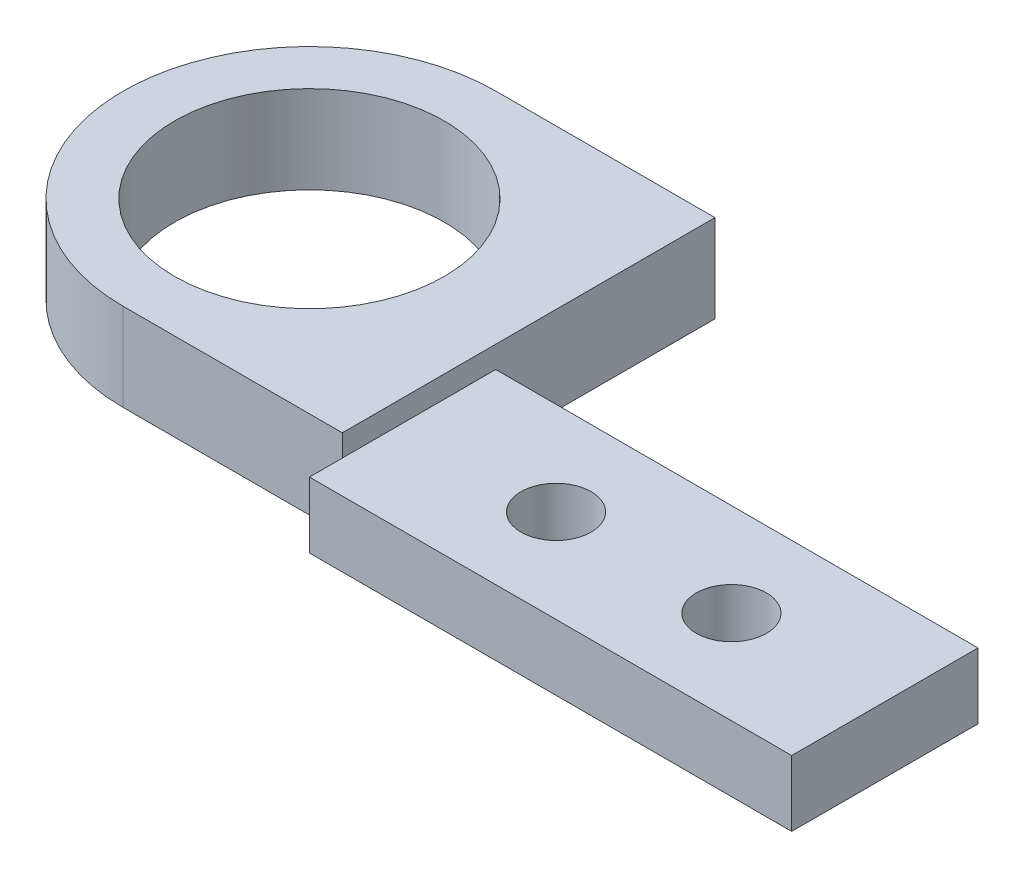
ISO-10303-21;
HEADER;
FILE_DESCRIPTION(('STEP AP214'),'2;1');
FILE_NAME('part.step','',(''),(''),'','','');
FILE_SCHEMA(('AUTOMOTIVE_DESIGN { 1 0 10303 214 1 1 1 1 }'));
ENDSEC;
DATA;
#1=APPLICATION_CONTEXT('core data for automotive mechanical design processes');
#2=APPLICATION_PROTOCOL_DEFINITION('international standard','automotive_design',2000,#1);
#3=PRODUCT_CONTEXT('',#1,'mechanical');
#4=PRODUCT('Part','Part','',(#3));
#5=PRODUCT_RELATED_PRODUCT_CATEGORY('part','',(#4));
#6=PRODUCT_DEFINITION_FORMATION('','',#4);
#7=PRODUCT_DEFINITION_CONTEXT('part definition',#1,'design');
#8=PRODUCT_DEFINITION('design','',#6,#7);
#9=PRODUCT_DEFINITION_SHAPE('','',#8);
#10=(LENGTH_UNIT() NAMED_UNIT(*) SI_UNIT(.MILLI.,.METRE.));
#11=(NAMED_UNIT(*) PLANE_ANGLE_UNIT() SI_UNIT($,.RADIAN.));
#12=(NAMED_UNIT(*) SI_UNIT($,.STERADIAN.) SOLID_ANGLE_UNIT());
#13=UNCERTAINTY_MEASURE_WITH_UNIT(LENGTH_MEASURE(1.E-05),#10,'distance_accuracy_value','');
#14=(GEOMETRIC_REPRESENTATION_CONTEXT(3) GLOBAL_UNCERTAINTY_ASSIGNED_CONTEXT((#13)) GLOBAL_UNIT_ASSIGNED_CONTEXT((#10,
#11,#12)) REPRESENTATION_CONTEXT('',''));
#15=CARTESIAN_POINT('',(0.,0.,0.));
#16=DIRECTION('',(0.,0.,1.));
#17=DIRECTION('',(1.,0.,0.));
#18=AXIS2_PLACEMENT_3D('',#15,#16,#17);
#19=CARTESIAN_POINT('',(0.,4.,0.));
#20=DIRECTION('',(0.,-1.,0.));
#21=DIRECTION('',(0.,0.,-1.));
#22=AXIS2_PLACEMENT_3D('',#19,#20,#21);
#23=CYLINDRICAL_SURFACE('',#22,8.5);
#24=CARTESIAN_POINT('',(0.,0.,0.));
#25=DIRECTION('',(0.,1.,0.));
#26=DIRECTION('',(0.,0.,1.));
#27=AXIS2_PLACEMENT_3D('',#24,#25,#26);
#28=CIRCLE('',#27,8.5);
#29=CARTESIAN_POINT('',(0.,0.,-8.5));
#30=VERTEX_POINT('',#29);
#31=CARTESIAN_POINT('',(0.,0.,8.5));
#32=VERTEX_POINT('',#31);
#33=EDGE_CURVE('E174',#30,#32,#28,.T.);
#34=ORIENTED_EDGE('',*,*,#33,.T.);
#35=DIRECTION('',(0.,-1.,0.));
#36=VECTOR('',#35,1.);
#37=CARTESIAN_POINT('',(0.,4.,8.5));
#38=LINE('',#37,#36);
#39=CARTESIAN_POINT('',(0.,4.,8.5));
#40=VERTEX_POINT('',#39);
#41=EDGE_CURVE('E11',#40,#32,#38,.T.);
#42=ORIENTED_EDGE('',*,*,#41,.F.);
#43=CARTESIAN_POINT('',(0.,4.,0.));
#44=DIRECTION('',(0.,1.,0.));
#45=DIRECTION('',(0.,0.,1.));
#46=AXIS2_PLACEMENT_3D('',#43,#44,#45);
#47=CIRCLE('',#46,8.5);
#48=CARTESIAN_POINT('',(0.,4.,-8.5));
#49=VERTEX_POINT('',#48);
#50=EDGE_CURVE('E164',#49,#40,#47,.T.);
#51=ORIENTED_EDGE('',*,*,#50,.F.);
#52=DIRECTION('',(0.,-1.,0.));
#53=VECTOR('',#52,1.);
#54=CARTESIAN_POINT('',(0.,4.,-8.5));
#55=LINE('',#54,#53);
#56=EDGE_CURVE('E54',#49,#30,#55,.T.);
#57=ORIENTED_EDGE('',*,*,#56,.T.);
#58=EDGE_LOOP('',(#34,#42,#51,#57));
#59=FACE_BOUND('',#58,.T.);
#60=ADVANCED_FACE('F35',(#59),#23,.T.);
#61=CARTESIAN_POINT('',(0.,4.,8.5));
#62=DIRECTION('',(0.,0.,-1.));
#63=DIRECTION('',(-1.,0.,0.));
#64=AXIS2_PLACEMENT_3D('',#61,#62,#63);
#65=PLANE('',#64);
#66=DIRECTION('',(1.,0.,0.));
#67=VECTOR('',#66,1.);
#68=CARTESIAN_POINT('',(0.,0.,8.5));
#69=LINE('',#68,#67);
#70=CARTESIAN_POINT('',(10.,0.,8.5));
#71=VERTEX_POINT('',#70);
#72=EDGE_CURVE('E176',#32,#71,#69,.T.);
#73=ORIENTED_EDGE('',*,*,#72,.T.);
#74=DIRECTION('',(0.,-1.,0.));
#75=VECTOR('',#74,1.);
#76=CARTESIAN_POINT('',(10.,4.,8.5));
#77=LINE('',#76,#75);
#78=CARTESIAN_POINT('',(10.,3.,8.5));
#79=VERTEX_POINT('',#78);
#80=EDGE_CURVE('E137',#79,#71,#77,.T.);
#81=ORIENTED_EDGE('',*,*,#80,.F.);
#82=CARTESIAN_POINT('',(10.,4.,8.5));
#83=VERTEX_POINT('',#82);
#84=EDGE_CURVE('E45',#83,#79,#77,.T.);
#85=ORIENTED_EDGE('',*,*,#84,.F.);
#86=DIRECTION('',(1.,0.,0.));
#87=VECTOR('',#86,1.);
#88=CARTESIAN_POINT('',(0.,4.,8.5));
#89=LINE('',#88,#87);
#90=EDGE_CURVE('E91',#40,#83,#89,.T.);
#91=ORIENTED_EDGE('',*,*,#90,.F.);
#92=ORIENTED_EDGE('',*,*,#41,.T.);
#93=EDGE_LOOP('',(#73,#81,#85,#91,#92));
#94=FACE_BOUND('',#93,.T.);
#95=ADVANCED_FACE('F209',(#94),#65,.F.);
#96=CARTESIAN_POINT('',(9.99999999999999,4.,0.));
#97=DIRECTION('',(1.,0.,0.));
#98=DIRECTION('',(0.,0.,-1.));
#99=AXIS2_PLACEMENT_3D('',#96,#97,#98);
#100=PLANE('',#99);
#101=DIRECTION('',(0.,-1.,0.));
#102=VECTOR('',#101,1.);
#103=CARTESIAN_POINT('',(10.,4.,10.));
#104=LINE('',#103,#102);
#105=CARTESIAN_POINT('',(10.,3.,10.));
#106=VERTEX_POINT('',#105);
#107=CARTESIAN_POINT('',(10.,0.,10.));
#108=VERTEX_POINT('',#107);
#109=EDGE_CURVE('E128',#106,#108,#104,.T.);
#110=ORIENTED_EDGE('',*,*,#109,.F.);
#111=DIRECTION('',(0.,0.,1.));
#112=VECTOR('',#111,1.);
#113=CARTESIAN_POINT('',(10.,3.,10.));
#114=LINE('',#113,#112);
#115=EDGE_CURVE('E113',#79,#106,#114,.T.);
#116=ORIENTED_EDGE('',*,*,#115,.F.);
#117=ORIENTED_EDGE('',*,*,#80,.T.);
#118=DIRECTION('',(0.,0.,1.));
#119=VECTOR('',#118,1.);
#120=CARTESIAN_POINT('',(9.99999999999999,0.,0.));
#121=LINE('',#120,#119);
#122=EDGE_CURVE('E135',#71,#108,#121,.T.);
#123=ORIENTED_EDGE('',*,*,#122,.T.);
#124=EDGE_LOOP('',(#110,#116,#117,#123));
#125=FACE_BOUND('',#124,.T.);
#126=ADVANCED_FACE('F133',(#125),#100,.F.);
#127=CARTESIAN_POINT('',(0.,4.,10.));
#128=DIRECTION('',(0.,0.,-1.));
#129=DIRECTION('',(-1.,0.,0.));
#130=AXIS2_PLACEMENT_3D('',#127,#128,#129);
#131=PLANE('',#130);
#132=DIRECTION('',(0.,-1.,0.));
#133=VECTOR('',#132,1.);
#134=CARTESIAN_POINT('',(32.,4.,10.));
#135=LINE('',#134,#133);
#136=CARTESIAN_POINT('',(32.,3.,10.));
#137=VERTEX_POINT('',#136);
#138=CARTESIAN_POINT('',(32.,0.,10.));
#139=VERTEX_POINT('',#138);
#140=EDGE_CURVE('E130',#137,#139,#135,.T.);
#141=ORIENTED_EDGE('',*,*,#140,.F.);
#142=DIRECTION('',(1.,0.,0.));
#143=VECTOR('',#142,1.);
#144=CARTESIAN_POINT('',(10.,3.,10.));
#145=LINE('',#144,#143);
#146=EDGE_CURVE('E116',#106,#137,#145,.T.);
#147=ORIENTED_EDGE('',*,*,#146,.F.);
#148=ORIENTED_EDGE('',*,*,#109,.T.);
#149=DIRECTION('',(1.,0.,0.));
#150=VECTOR('',#149,1.);
#151=CARTESIAN_POINT('',(0.,0.,10.));
#152=LINE('',#151,#150);
#153=EDGE_CURVE('E180',#108,#139,#152,.T.);
#154=ORIENTED_EDGE('',*,*,#153,.T.);
#155=EDGE_LOOP('',(#141,#147,#148,#154));
#156=FACE_BOUND('',#155,.T.);
#157=ADVANCED_FACE('F126',(#156),#131,.F.);
#158=CARTESIAN_POINT('',(32.,4.,0.));
#159=DIRECTION('',(1.,0.,0.));
#160=DIRECTION('',(0.,0.,-1.));
#161=AXIS2_PLACEMENT_3D('',#158,#159,#160);
#162=PLANE('',#161);
#163=DIRECTION('',(0.,0.,-1.));
#164=VECTOR('',#163,1.);
#165=CARTESIAN_POINT('',(32.,3.,10.));
#166=LINE('',#165,#164);
#167=CARTESIAN_POINT('',(32.,3.,1.5));
#168=VERTEX_POINT('',#167);
#169=EDGE_CURVE('E131',#137,#168,#166,.T.);
#170=ORIENTED_EDGE('',*,*,#169,.F.);
#171=ORIENTED_EDGE('',*,*,#140,.T.);
#172=DIRECTION('',(0.,0.,1.));
#173=VECTOR('',#172,1.);
#174=CARTESIAN_POINT('',(32.,0.,0.));
#175=LINE('',#174,#173);
#176=CARTESIAN_POINT('',(32.,0.,1.5));
#177=VERTEX_POINT('',#176);
#178=EDGE_CURVE('E182',#177,#139,#175,.T.);
#179=ORIENTED_EDGE('',*,*,#178,.F.);
#180=DIRECTION('',(0.,-1.,0.));
#181=VECTOR('',#180,1.);
#182=CARTESIAN_POINT('',(32.,4.,1.5));
#183=LINE('',#182,#181);
#184=EDGE_CURVE('E140',#168,#177,#183,.T.);
#185=ORIENTED_EDGE('',*,*,#184,.F.);
#186=EDGE_LOOP('',(#170,#171,#179,#185));
#187=FACE_BOUND('',#186,.T.);
#188=ADVANCED_FACE('F203',(#187),#162,.T.);
#189=CARTESIAN_POINT('',(0.,4.,1.5));
#190=DIRECTION('',(0.,0.,-1.));
#191=DIRECTION('',(-1.,0.,0.));
#192=AXIS2_PLACEMENT_3D('',#189,#190,#191);
#193=PLANE('',#192);
#194=DIRECTION('',(-1.,0.,0.));
#195=VECTOR('',#194,1.);
#196=CARTESIAN_POINT('',(10.,3.,1.5));
#197=LINE('',#196,#195);
#198=CARTESIAN_POINT('',(10.,3.,1.5));
#199=VERTEX_POINT('',#198);
#200=EDGE_CURVE('E158',#168,#199,#197,.T.);
#201=ORIENTED_EDGE('',*,*,#200,.F.);
#202=ORIENTED_EDGE('',*,*,#184,.T.);
#203=DIRECTION('',(1.,0.,0.));
#204=VECTOR('',#203,1.);
#205=CARTESIAN_POINT('',(0.,0.,1.5));
#206=LINE('',#205,#204);
#207=CARTESIAN_POINT('',(10.,0.,1.5));
#208=VERTEX_POINT('',#207);
#209=EDGE_CURVE('E185',#208,#177,#206,.T.);
#210=ORIENTED_EDGE('',*,*,#209,.F.);
#211=DIRECTION('',(0.,-1.,0.));
#212=VECTOR('',#211,1.);
#213=CARTESIAN_POINT('',(10.,4.,1.5));
#214=LINE('',#213,#212);
#215=EDGE_CURVE('E194',#199,#208,#214,.T.);
#216=ORIENTED_EDGE('',*,*,#215,.F.);
#217=EDGE_LOOP('',(#201,#202,#210,#216));
#218=FACE_BOUND('',#217,.T.);
#219=ADVANCED_FACE('F200',(#218),#193,.T.);
#220=CARTESIAN_POINT('',(10.,4.,0.));
#221=DIRECTION('',(-1.,0.,0.));
#222=DIRECTION('',(0.,0.,1.));
#223=AXIS2_PLACEMENT_3D('',#220,#221,#222);
#224=PLANE('',#223);
#225=DIRECTION('',(0.,0.,-1.));
#226=VECTOR('',#225,1.);
#227=CARTESIAN_POINT('',(10.,0.,0.));
#228=LINE('',#227,#226);
#229=CARTESIAN_POINT('',(10.,0.,-8.5));
#230=VERTEX_POINT('',#229);
#231=EDGE_CURVE('E188',#208,#230,#228,.T.);
#232=ORIENTED_EDGE('',*,*,#231,.T.);
#233=DIRECTION('',(0.,-1.,0.));
#234=VECTOR('',#233,1.);
#235=CARTESIAN_POINT('',(10.,4.,-8.5));
#236=LINE('',#235,#234);
#237=CARTESIAN_POINT('',(10.,4.,-8.5));
#238=VERTEX_POINT('',#237);
#239=EDGE_CURVE('E82',#238,#230,#236,.T.);
#240=ORIENTED_EDGE('',*,*,#239,.F.);
#241=DIRECTION('',(0.,0.,-1.));
#242=VECTOR('',#241,1.);
#243=CARTESIAN_POINT('',(10.,4.,0.));
#244=LINE('',#243,#242);
#245=EDGE_CURVE('E168',#83,#238,#244,.T.);
#246=ORIENTED_EDGE('',*,*,#245,.F.);
#247=ORIENTED_EDGE('',*,*,#84,.T.);
#248=EDGE_CURVE('E119',#199,#79,#114,.T.);
#249=ORIENTED_EDGE('',*,*,#248,.F.);
#250=ORIENTED_EDGE('',*,*,#215,.T.);
#251=EDGE_LOOP('',(#232,#240,#246,#247,#249,#250));
#252=FACE_BOUND('',#251,.T.);
#253=ADVANCED_FACE('F208',(#252),#224,.F.);
#254=CARTESIAN_POINT('',(0.,4.,0.));
#255=DIRECTION('',(0.,-1.,0.));
#256=DIRECTION('',(0.,0.,-1.));
#257=AXIS2_PLACEMENT_3D('',#254,#255,#256);
#258=CYLINDRICAL_SURFACE('',#257,6.15);
#259=CARTESIAN_POINT('',(0.,4.,0.));
#260=DIRECTION('',(0.,1.,0.));
#261=DIRECTION('',(0.,0.,1.));
#262=AXIS2_PLACEMENT_3D('',#259,#260,#261);
#263=CIRCLE('',#262,6.15);
#264=CARTESIAN_POINT('',(0.,4.,6.15));
#265=VERTEX_POINT('',#264);
#266=EDGE_CURVE('E161',#265,#265,#263,.T.);
#267=ORIENTED_EDGE('',*,*,#266,.T.);
#268=EDGE_LOOP('',(#267));
#269=FACE_BOUND('',#268,.T.);
#270=CARTESIAN_POINT('',(0.,0.,0.));
#271=DIRECTION('',(0.,1.,0.));
#272=DIRECTION('',(0.,0.,1.));
#273=AXIS2_PLACEMENT_3D('',#270,#271,#272);
#274=CIRCLE('',#273,6.15);
#275=CARTESIAN_POINT('',(0.,0.,6.15));
#276=VERTEX_POINT('',#275);
#277=EDGE_CURVE('E160',#276,#276,#274,.T.);
#278=ORIENTED_EDGE('',*,*,#277,.F.);
#279=EDGE_LOOP('',(#278));
#280=FACE_BOUND('',#279,.T.);
#281=ADVANCED_FACE('F37',(#269,#280),#258,.F.);
#282=CARTESIAN_POINT('',(0.,4.,-8.5));
#283=DIRECTION('',(0.,0.,-1.));
#284=DIRECTION('',(-1.,0.,0.));
#285=AXIS2_PLACEMENT_3D('',#282,#283,#284);
#286=PLANE('',#285);
#287=DIRECTION('',(1.,0.,0.));
#288=VECTOR('',#287,1.);
#289=CARTESIAN_POINT('',(0.,0.,-8.5));
#290=LINE('',#289,#288);
#291=EDGE_CURVE('E165',#30,#230,#290,.T.);
#292=ORIENTED_EDGE('',*,*,#291,.F.);
#293=ORIENTED_EDGE('',*,*,#56,.F.);
#294=DIRECTION('',(1.,0.,0.));
#295=VECTOR('',#294,1.);
#296=CARTESIAN_POINT('',(0.,4.,-8.5));
#297=LINE('',#296,#295);
#298=EDGE_CURVE('E170',#49,#238,#297,.T.);
#299=ORIENTED_EDGE('',*,*,#298,.T.);
#300=ORIENTED_EDGE('',*,*,#239,.T.);
#301=EDGE_LOOP('',(#292,#293,#299,#300));
#302=FACE_BOUND('',#301,.T.);
#303=ADVANCED_FACE('F211',(#302),#286,.T.);
#304=CARTESIAN_POINT('',(0.,4.,0.));
#305=DIRECTION('',(0.,1.,0.));
#306=DIRECTION('',(0.,0.,1.));
#307=AXIS2_PLACEMENT_3D('',#304,#305,#306);
#308=PLANE('',#307);
#309=ORIENTED_EDGE('',*,*,#90,.T.);
#310=ORIENTED_EDGE('',*,*,#245,.T.);
#311=ORIENTED_EDGE('',*,*,#298,.F.);
#312=ORIENTED_EDGE('',*,*,#50,.T.);
#313=EDGE_LOOP('',(#309,#310,#311,#312));
#314=FACE_BOUND('',#313,.T.);
#315=ORIENTED_EDGE('',*,*,#266,.F.);
#316=EDGE_LOOP('',(#315));
#317=FACE_BOUND('',#316,.T.);
#318=ADVANCED_FACE('F213',(#314,#317),#308,.T.);
#319=CARTESIAN_POINT('',(0.,0.,0.));
#320=DIRECTION('',(0.,1.,0.));
#321=DIRECTION('',(0.,0.,1.));
#322=AXIS2_PLACEMENT_3D('',#319,#320,#321);
#323=PLANE('',#322);
#324=CARTESIAN_POINT('',(17.,0.,5.75));
#325=DIRECTION('',(0.,-1.,0.));
#326=DIRECTION('',(0.,0.,-1.));
#327=AXIS2_PLACEMENT_3D('',#324,#325,#326);
#328=CIRCLE('',#327,1.6);
#329=CARTESIAN_POINT('',(17.,0.,4.15));
#330=VERTEX_POINT('',#329);
#331=EDGE_CURVE('E145',#330,#330,#328,.T.);
#332=ORIENTED_EDGE('',*,*,#331,.F.);
#333=EDGE_LOOP('',(#332));
#334=FACE_BOUND('',#333,.T.);
#335=CARTESIAN_POINT('',(25.,0.,5.75));
#336=DIRECTION('',(0.,-1.,0.));
#337=DIRECTION('',(0.,0.,-1.));
#338=AXIS2_PLACEMENT_3D('',#335,#336,#337);
#339=CIRCLE('',#338,1.6);
#340=CARTESIAN_POINT('',(25.,0.,4.15));
#341=VERTEX_POINT('',#340);
#342=EDGE_CURVE('E150',#341,#341,#339,.T.);
#343=ORIENTED_EDGE('',*,*,#342,.F.);
#344=EDGE_LOOP('',(#343));
#345=FACE_BOUND('',#344,.T.);
#346=ORIENTED_EDGE('',*,*,#277,.T.);
#347=EDGE_LOOP('',(#346));
#348=FACE_BOUND('',#347,.T.);
#349=ORIENTED_EDGE('',*,*,#33,.F.);
#350=ORIENTED_EDGE('',*,*,#291,.T.);
#351=ORIENTED_EDGE('',*,*,#231,.F.);
#352=ORIENTED_EDGE('',*,*,#209,.T.);
#353=ORIENTED_EDGE('',*,*,#178,.T.);
#354=ORIENTED_EDGE('',*,*,#153,.F.);
#355=ORIENTED_EDGE('',*,*,#122,.F.);
#356=ORIENTED_EDGE('',*,*,#72,.F.);
#357=EDGE_LOOP('',(#349,#350,#351,#352,#353,#354,#355,#356));
#358=FACE_BOUND('',#357,.T.);
#359=ADVANCED_FACE('F206',(#334,#345,#348,#358),#323,.F.);
#360=CARTESIAN_POINT('',(0.,3.,0.));
#361=DIRECTION('',(0.,-1.,0.));
#362=DIRECTION('',(0.,0.,-1.));
#363=AXIS2_PLACEMENT_3D('',#360,#361,#362);
#364=PLANE('',#363);
#365=CARTESIAN_POINT('',(17.,3.,5.75));
#366=DIRECTION('',(0.,-1.,0.));
#367=DIRECTION('',(0.,0.,-1.));
#368=AXIS2_PLACEMENT_3D('',#365,#366,#367);
#369=CIRCLE('',#368,1.6);
#370=CARTESIAN_POINT('',(17.,3.,4.15));
#371=VERTEX_POINT('',#370);
#372=EDGE_CURVE('E39',#371,#371,#369,.T.);
#373=ORIENTED_EDGE('',*,*,#372,.T.);
#374=EDGE_LOOP('',(#373));
#375=FACE_BOUND('',#374,.T.);
#376=CARTESIAN_POINT('',(25.,3.,5.75));
#377=DIRECTION('',(0.,-1.,0.));
#378=DIRECTION('',(0.,0.,-1.));
#379=AXIS2_PLACEMENT_3D('',#376,#377,#378);
#380=CIRCLE('',#379,1.6);
#381=CARTESIAN_POINT('',(25.,3.,4.15));
#382=VERTEX_POINT('',#381);
#383=EDGE_CURVE('E143',#382,#382,#380,.T.);
#384=ORIENTED_EDGE('',*,*,#383,.T.);
#385=EDGE_LOOP('',(#384));
#386=FACE_BOUND('',#385,.T.);
#387=ORIENTED_EDGE('',*,*,#248,.T.);
#388=ORIENTED_EDGE('',*,*,#115,.T.);
#389=ORIENTED_EDGE('',*,*,#146,.T.);
#390=ORIENTED_EDGE('',*,*,#169,.T.);
#391=ORIENTED_EDGE('',*,*,#200,.T.);
#392=EDGE_LOOP('',(#387,#388,#389,#390,#391));
#393=FACE_BOUND('',#392,.T.);
#394=ADVANCED_FACE('F115',(#375,#386,#393),#364,.F.);
#395=CARTESIAN_POINT('',(25.,4.,5.75));
#396=DIRECTION('',(0.,-1.,0.));
#397=DIRECTION('',(0.,0.,-1.));
#398=AXIS2_PLACEMENT_3D('',#395,#396,#397);
#399=CYLINDRICAL_SURFACE('',#398,1.6);
#400=ORIENTED_EDGE('',*,*,#342,.T.);
#401=EDGE_LOOP('',(#400));
#402=FACE_BOUND('',#401,.T.);
#403=ORIENTED_EDGE('',*,*,#383,.F.);
#404=EDGE_LOOP('',(#403));
#405=FACE_BOUND('',#404,.T.);
#406=ADVANCED_FACE('F303',(#402,#405),#399,.F.);
#407=CARTESIAN_POINT('',(17.,4.,5.75));
#408=DIRECTION('',(0.,-1.,0.));
#409=DIRECTION('',(0.,0.,-1.));
#410=AXIS2_PLACEMENT_3D('',#407,#408,#409);
#411=CYLINDRICAL_SURFACE('',#410,1.6);
#412=ORIENTED_EDGE('',*,*,#331,.T.);
#413=EDGE_LOOP('',(#412));
#414=FACE_BOUND('',#413,.T.);
#415=ORIENTED_EDGE('',*,*,#372,.F.);
#416=EDGE_LOOP('',(#415));
#417=FACE_BOUND('',#416,.T.);
#418=ADVANCED_FACE('F312',(#414,#417),#411,.F.);
#419=CLOSED_SHELL('',(#60,#95,#126,#157,#188,#219,#253,#281,#303,#318,#359,#394,#406,#418));
#420=MANIFOLD_SOLID_BREP('B2',#419);
#421=ADVANCED_BREP_SHAPE_REPRESENTATION('',(#18,#420),#14);
#422=SHAPE_DEFINITION_REPRESENTATION(#9,#421);
ENDSEC;
END-ISO-10303-21;
